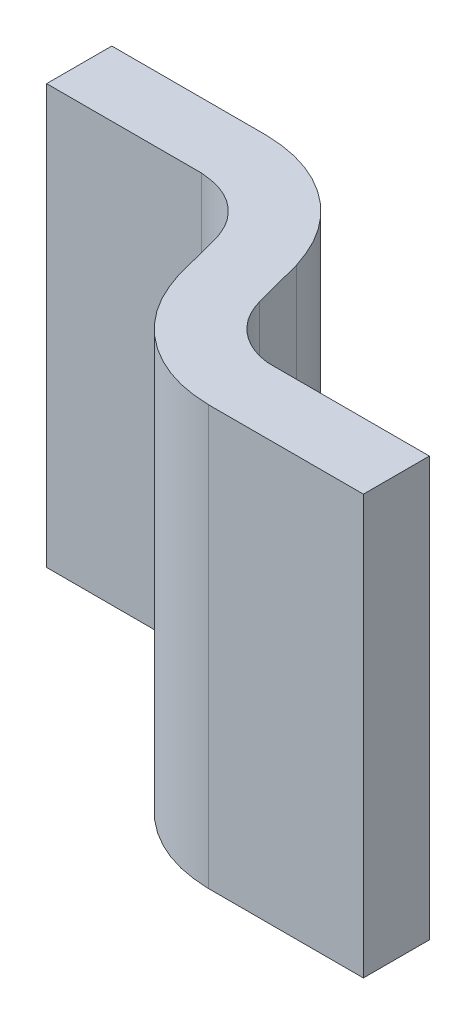
ISO-10303-21;
HEADER;
FILE_DESCRIPTION(('STEP AP214'),'2;1');
FILE_NAME('part.step','',(''),(''),'','','');
FILE_SCHEMA(('AUTOMOTIVE_DESIGN { 1 0 10303 214 1 1 1 1 }'));
ENDSEC;
DATA;
#1=APPLICATION_CONTEXT('core data for automotive mechanical design processes');
#2=APPLICATION_PROTOCOL_DEFINITION('international standard','automotive_design',2000,#1);
#3=PRODUCT_CONTEXT('',#1,'mechanical');
#4=PRODUCT('Part','Part','',(#3));
#5=PRODUCT_RELATED_PRODUCT_CATEGORY('part','',(#4));
#6=PRODUCT_DEFINITION_FORMATION('','',#4);
#7=PRODUCT_DEFINITION_CONTEXT('part definition',#1,'design');
#8=PRODUCT_DEFINITION('design','',#6,#7);
#9=PRODUCT_DEFINITION_SHAPE('','',#8);
#10=(LENGTH_UNIT() NAMED_UNIT(*) SI_UNIT(.MILLI.,.METRE.));
#11=(NAMED_UNIT(*) PLANE_ANGLE_UNIT() SI_UNIT($,.RADIAN.));
#12=(NAMED_UNIT(*) SI_UNIT($,.STERADIAN.) SOLID_ANGLE_UNIT());
#13=UNCERTAINTY_MEASURE_WITH_UNIT(LENGTH_MEASURE(1.E-05),#10,'distance_accuracy_value','');
#14=(GEOMETRIC_REPRESENTATION_CONTEXT(3) GLOBAL_UNCERTAINTY_ASSIGNED_CONTEXT((#13)) GLOBAL_UNIT_ASSIGNED_CONTEXT((#10,
#11,#12)) REPRESENTATION_CONTEXT('',''));
#15=CARTESIAN_POINT('',(0.,0.,0.));
#16=DIRECTION('',(0.,0.,1.));
#17=DIRECTION('',(1.,0.,0.));
#18=AXIS2_PLACEMENT_3D('',#15,#16,#17);
#19=CARTESIAN_POINT('',(-0.876,-1.204,0.238));
#20=DIRECTION('',(1.,0.,0.));
#21=DIRECTION('',(0.,0.,1.));
#22=AXIS2_PLACEMENT_3D('',#19,#20,#21);
#23=PLANE('',#22);
#24=DIRECTION('',(0.,-1.,0.));
#25=VECTOR('',#24,1.);
#26=CARTESIAN_POINT('',(-0.876,-0.696,0.238));
#27=LINE('',#26,#25);
#28=CARTESIAN_POINT('',(-0.876,-0.696,0.238));
#29=VERTEX_POINT('',#28);
#30=CARTESIAN_POINT('',(-0.876,-1.204,0.238));
#31=VERTEX_POINT('',#30);
#32=EDGE_CURVE('E11',#29,#31,#27,.T.);
#33=ORIENTED_EDGE('',*,*,#32,.F.);
#34=DIRECTION('',(0.,0.,-1.));
#35=VECTOR('',#34,1.);
#36=CARTESIAN_POINT('',(-0.876,-0.696,0.318));
#37=LINE('',#36,#35);
#38=CARTESIAN_POINT('',(-0.876,-0.696,0.318));
#39=VERTEX_POINT('',#38);
#40=EDGE_CURVE('E24',#39,#29,#37,.T.);
#41=ORIENTED_EDGE('',*,*,#40,.F.);
#42=DIRECTION('',(0.,1.,0.));
#43=VECTOR('',#42,1.);
#44=CARTESIAN_POINT('',(-0.876,-1.204,0.318));
#45=LINE('',#44,#43);
#46=CARTESIAN_POINT('',(-0.876,-1.204,0.318));
#47=VERTEX_POINT('',#46);
#48=EDGE_CURVE('E439',#47,#39,#45,.T.);
#49=ORIENTED_EDGE('',*,*,#48,.F.);
#50=DIRECTION('',(0.,0.,1.));
#51=VECTOR('',#50,1.);
#52=CARTESIAN_POINT('',(-0.876,-1.204,0.238));
#53=LINE('',#52,#51);
#54=EDGE_CURVE('E437',#31,#47,#53,.T.);
#55=ORIENTED_EDGE('',*,*,#54,.F.);
#56=EDGE_LOOP('',(#33,#41,#49,#55));
#57=FACE_BOUND('',#56,.T.);
#58=ADVANCED_FACE('F17',(#57),#23,.T.);
#59=CARTESIAN_POINT('',(-0.876,-1.204,0.318));
#60=DIRECTION('',(0.,0.,1.));
#61=DIRECTION('',(0.,1.,0.));
#62=AXIS2_PLACEMENT_3D('',#59,#60,#61);
#63=PLANE('',#62);
#64=ORIENTED_EDGE('',*,*,#48,.T.);
#65=DIRECTION('',(1.,0.,0.));
#66=VECTOR('',#65,1.);
#67=CARTESIAN_POINT('',(-1.064,-0.696,0.318));
#68=LINE('',#67,#66);
#69=CARTESIAN_POINT('',(-1.064,-0.696,0.318));
#70=VERTEX_POINT('',#69);
#71=EDGE_CURVE('E435',#70,#39,#68,.T.);
#72=ORIENTED_EDGE('',*,*,#71,.F.);
#73=CARTESIAN_POINT('',(-1.064,-1.204,0.31775));
#74=DIRECTION('',(0.,1.,0.));
#75=VECTOR('',#74,1.);
#76=LINE('',#73,#75);
#77=CARTESIAN_POINT('',(-1.064,-1.204,0.318));
#78=VERTEX_POINT('',#77);
#79=EDGE_CURVE('E257',#78,#70,#76,.T.);
#80=ORIENTED_EDGE('',*,*,#79,.F.);
#81=DIRECTION('',(-1.,0.,0.));
#82=VECTOR('',#81,1.);
#83=CARTESIAN_POINT('',(-0.876,-1.204,0.318));
#84=LINE('',#83,#82);
#85=EDGE_CURVE('E247',#47,#78,#84,.T.);
#86=ORIENTED_EDGE('',*,*,#85,.F.);
#87=EDGE_LOOP('',(#64,#72,#80,#86));
#88=FACE_BOUND('',#87,.T.);
#89=ADVANCED_FACE('F237',(#88),#63,.T.);
#90=CARTESIAN_POINT('',(-0.876,-0.696,0.238));
#91=DIRECTION('',(0.,0.,-1.));
#92=DIRECTION('',(0.,1.,0.));
#93=AXIS2_PLACEMENT_3D('',#90,#91,#92);
#94=PLANE('',#93);
#95=ORIENTED_EDGE('',*,*,#32,.T.);
#96=DIRECTION('',(1.,0.,0.));
#97=VECTOR('',#96,1.);
#98=CARTESIAN_POINT('',(-1.064,-1.204,0.238));
#99=LINE('',#98,#97);
#100=CARTESIAN_POINT('',(-1.064,-1.204,0.238));
#101=VERTEX_POINT('',#100);
#102=EDGE_CURVE('E443',#101,#31,#99,.T.);
#103=ORIENTED_EDGE('',*,*,#102,.F.);
#104=CARTESIAN_POINT('',(-1.064,-0.696,0.238375));
#105=DIRECTION('',(0.,-1.,0.));
#106=VECTOR('',#105,1.);
#107=LINE('',#104,#106);
#108=CARTESIAN_POINT('',(-1.064,-0.696,0.238));
#109=VERTEX_POINT('',#108);
#110=EDGE_CURVE('E222',#109,#101,#107,.T.);
#111=ORIENTED_EDGE('',*,*,#110,.F.);
#112=DIRECTION('',(-1.,0.,0.));
#113=VECTOR('',#112,1.);
#114=CARTESIAN_POINT('',(-0.876,-0.696,0.238));
#115=LINE('',#114,#113);
#116=EDGE_CURVE('E219',#29,#109,#115,.T.);
#117=ORIENTED_EDGE('',*,*,#116,.F.);
#118=EDGE_LOOP('',(#95,#103,#111,#117));
#119=FACE_BOUND('',#118,.T.);
#120=ADVANCED_FACE('F228',(#119),#94,.T.);
#121=CARTESIAN_POINT('',(-1.234,-0.696,0.138));
#122=DIRECTION('',(-0.965885549343203,0.,0.258969313954337));
#123=DIRECTION('',(0.258969313954337,0.,0.965885549343203));
#124=AXIS2_PLACEMENT_3D('',#121,#122,#123);
#125=PLANE('',#124);
#126=CARTESIAN_POINT('',(-1.23442187168926,-1.204,0.138115055915251));
#127=DIRECTION('',(0.,1.,0.));
#128=VECTOR('',#127,1.);
#129=LINE('',#126,#128);
#130=CARTESIAN_POINT('',(-1.234,-1.204,0.138));
#131=VERTEX_POINT('',#130);
#132=CARTESIAN_POINT('',(-1.234,-0.696,0.138));
#133=VERTEX_POINT('',#132);
#134=EDGE_CURVE('E215',#131,#133,#129,.T.);
#135=ORIENTED_EDGE('',*,*,#134,.F.);
#136=CARTESIAN_POINT('',(-1.218,-1.204,0.2));
#137=DIRECTION('',(-0.258969313954338,0.,-0.965885549343202));
#138=VECTOR('',#137,1.);
#139=LINE('',#136,#138);
#140=CARTESIAN_POINT('',(-1.218,-1.204,0.2));
#141=VERTEX_POINT('',#140);
#142=EDGE_CURVE('E301',#141,#131,#139,.T.);
#143=ORIENTED_EDGE('',*,*,#142,.F.);
#144=CARTESIAN_POINT('',(-1.21740631765688,-0.696,0.199841941713844));
#145=DIRECTION('',(0.,-1.,0.));
#146=VECTOR('',#145,1.);
#147=LINE('',#144,#146);
#148=CARTESIAN_POINT('',(-1.218,-0.696,0.2));
#149=VERTEX_POINT('',#148);
#150=EDGE_CURVE('E288',#149,#141,#147,.T.);
#151=ORIENTED_EDGE('',*,*,#150,.F.);
#152=DIRECTION('',(0.258969313954337,0.,0.965885549343203));
#153=VECTOR('',#152,1.);
#154=CARTESIAN_POINT('',(-1.234,-0.696,0.138));
#155=LINE('',#154,#153);
#156=EDGE_CURVE('E356',#133,#149,#155,.T.);
#157=ORIENTED_EDGE('',*,*,#156,.F.);
#158=EDGE_LOOP('',(#135,#143,#151,#157));
#159=FACE_BOUND('',#158,.T.);
#160=ADVANCED_FACE('F236',(#159),#125,.T.);
#161=CARTESIAN_POINT('',(-1.157,-1.204,0.118));
#162=DIRECTION('',(0.965885549343203,0.,-0.258969313954337));
#163=DIRECTION('',(0.258969313954337,0.,0.965885549343203));
#164=AXIS2_PLACEMENT_3D('',#161,#162,#163);
#165=PLANE('',#164);
#166=CARTESIAN_POINT('',(-1.15759368234312,-0.696,0.118158058286156));
#167=DIRECTION('',(0.,-1.,0.));
#168=VECTOR('',#167,1.);
#169=LINE('',#166,#168);
#170=CARTESIAN_POINT('',(-1.157,-0.696,0.118));
#171=VERTEX_POINT('',#170);
#172=CARTESIAN_POINT('',(-1.157,-1.204,0.118));
#173=VERTEX_POINT('',#172);
#174=EDGE_CURVE('E342',#171,#173,#169,.T.);
#175=ORIENTED_EDGE('',*,*,#174,.F.);
#176=CARTESIAN_POINT('',(-1.141,-0.696,0.179));
#177=DIRECTION('',(-0.258969313954335,0.,-0.965885549343203));
#178=VECTOR('',#177,1.);
#179=LINE('',#176,#178);
#180=CARTESIAN_POINT('',(-1.141,-0.696,0.179));
#181=VERTEX_POINT('',#180);
#182=EDGE_CURVE('E330',#181,#171,#179,.T.);
#183=ORIENTED_EDGE('',*,*,#182,.F.);
#184=CARTESIAN_POINT('',(-1.14082576891933,-1.204,0.178954745173853));
#185=DIRECTION('',(0.,1.,0.));
#186=VECTOR('',#185,1.);
#187=LINE('',#184,#186);
#188=CARTESIAN_POINT('',(-1.141,-1.204,0.179));
#189=VERTEX_POINT('',#188);
#190=EDGE_CURVE('E366',#189,#181,#187,.T.);
#191=ORIENTED_EDGE('',*,*,#190,.F.);
#192=DIRECTION('',(0.258969313954337,0.,0.965885549343203));
#193=VECTOR('',#192,1.);
#194=CARTESIAN_POINT('',(-1.157,-1.204,0.118));
#195=LINE('',#194,#193);
#196=EDGE_CURVE('E368',#173,#189,#195,.T.);
#197=ORIENTED_EDGE('',*,*,#196,.F.);
#198=EDGE_LOOP('',(#175,#183,#191,#197));
#199=FACE_BOUND('',#198,.T.);
#200=ADVANCED_FACE('F160',(#199),#165,.T.);
#201=CARTESIAN_POINT('',(-1.499,-0.696,0.079));
#202=DIRECTION('',(0.,0.,1.));
#203=DIRECTION('',(0.,1.,0.));
#204=AXIS2_PLACEMENT_3D('',#201,#202,#203);
#205=PLANE('',#204);
#206=DIRECTION('',(0.,1.,0.));
#207=VECTOR('',#206,1.);
#208=CARTESIAN_POINT('',(-1.499,-1.204,0.079));
#209=LINE('',#208,#207);
#210=CARTESIAN_POINT('',(-1.499,-1.204,0.079));
#211=VERTEX_POINT('',#210);
#212=CARTESIAN_POINT('',(-1.499,-0.696,0.079));
#213=VERTEX_POINT('',#212);
#214=EDGE_CURVE('E125',#211,#213,#209,.T.);
#215=ORIENTED_EDGE('',*,*,#214,.F.);
#216=DIRECTION('',(-1.,0.,0.));
#217=VECTOR('',#216,1.);
#218=CARTESIAN_POINT('',(-1.311,-1.204,0.079));
#219=LINE('',#218,#217);
#220=CARTESIAN_POINT('',(-1.311,-1.204,0.079));
#221=VERTEX_POINT('',#220);
#222=EDGE_CURVE('E377',#221,#211,#219,.T.);
#223=ORIENTED_EDGE('',*,*,#222,.F.);
#224=CARTESIAN_POINT('',(-1.311,-0.696,0.079625));
#225=DIRECTION('',(0.,-1.,0.));
#226=VECTOR('',#225,1.);
#227=LINE('',#224,#226);
#228=CARTESIAN_POINT('',(-1.311,-0.696,0.079));
#229=VERTEX_POINT('',#228);
#230=EDGE_CURVE('E178',#229,#221,#227,.T.);
#231=ORIENTED_EDGE('',*,*,#230,.F.);
#232=DIRECTION('',(1.,0.,0.));
#233=VECTOR('',#232,1.);
#234=CARTESIAN_POINT('',(-1.499,-0.696,0.079));
#235=LINE('',#234,#233);
#236=EDGE_CURVE('E169',#213,#229,#235,.T.);
#237=ORIENTED_EDGE('',*,*,#236,.F.);
#238=EDGE_LOOP('',(#215,#223,#231,#237));
#239=FACE_BOUND('',#238,.T.);
#240=ADVANCED_FACE('F155',(#239),#205,.T.);
#241=CARTESIAN_POINT('',(-1.311,-0.696,0.));
#242=DIRECTION('',(0.,0.,-1.));
#243=DIRECTION('',(0.,1.,0.));
#244=AXIS2_PLACEMENT_3D('',#241,#242,#243);
#245=PLANE('',#244);
#246=CARTESIAN_POINT('',(-1.311,-1.204,0.000249999999999979));
#247=DIRECTION('',(0.,1.,0.));
#248=VECTOR('',#247,1.);
#249=LINE('',#246,#248);
#250=CARTESIAN_POINT('',(-1.311,-1.204,0.));
#251=VERTEX_POINT('',#250);
#252=CARTESIAN_POINT('',(-1.311,-0.696,0.));
#253=VERTEX_POINT('',#252);
#254=EDGE_CURVE('E140',#251,#253,#249,.T.);
#255=ORIENTED_EDGE('',*,*,#254,.F.);
#256=DIRECTION('',(1.,0.,0.));
#257=VECTOR('',#256,1.);
#258=CARTESIAN_POINT('',(-1.499,-1.204,0.));
#259=LINE('',#258,#257);
#260=CARTESIAN_POINT('',(-1.499,-1.204,0.));
#261=VERTEX_POINT('',#260);
#262=EDGE_CURVE('E107',#261,#251,#259,.T.);
#263=ORIENTED_EDGE('',*,*,#262,.F.);
#264=DIRECTION('',(0.,-1.,0.));
#265=VECTOR('',#264,1.);
#266=CARTESIAN_POINT('',(-1.499,-0.696,0.));
#267=LINE('',#266,#265);
#268=CARTESIAN_POINT('',(-1.499,-0.696,0.));
#269=VERTEX_POINT('',#268);
#270=EDGE_CURVE('E101',#269,#261,#267,.T.);
#271=ORIENTED_EDGE('',*,*,#270,.F.);
#272=DIRECTION('',(-1.,0.,0.));
#273=VECTOR('',#272,1.);
#274=CARTESIAN_POINT('',(-1.311,-0.696,0.));
#275=LINE('',#274,#273);
#276=EDGE_CURVE('E104',#253,#269,#275,.T.);
#277=ORIENTED_EDGE('',*,*,#276,.F.);
#278=EDGE_LOOP('',(#255,#263,#271,#277));
#279=FACE_BOUND('',#278,.T.);
#280=ADVANCED_FACE('F103',(#279),#245,.T.);
#281=CARTESIAN_POINT('',(-1.499,-0.696,0.));
#282=DIRECTION('',(-1.,0.,0.));
#283=DIRECTION('',(0.,0.,1.));
#284=AXIS2_PLACEMENT_3D('',#281,#282,#283);
#285=PLANE('',#284);
#286=ORIENTED_EDGE('',*,*,#270,.T.);
#287=DIRECTION('',(0.,0.,-1.));
#288=VECTOR('',#287,1.);
#289=CARTESIAN_POINT('',(-1.499,-1.204,0.079));
#290=LINE('',#289,#288);
#291=EDGE_CURVE('E122',#211,#261,#290,.T.);
#292=ORIENTED_EDGE('',*,*,#291,.F.);
#293=ORIENTED_EDGE('',*,*,#214,.T.);
#294=DIRECTION('',(0.,0.,1.));
#295=VECTOR('',#294,1.);
#296=CARTESIAN_POINT('',(-1.499,-0.696,0.));
#297=LINE('',#296,#295);
#298=EDGE_CURVE('E118',#269,#213,#297,.T.);
#299=ORIENTED_EDGE('',*,*,#298,.F.);
#300=EDGE_LOOP('',(#286,#292,#293,#299));
#301=FACE_BOUND('',#300,.T.);
#302=ADVANCED_FACE('F124',(#301),#285,.T.);
#303=CARTESIAN_POINT('',(-1.064,-1.204,0.159));
#304=DIRECTION('',(0.,-1.,0.));
#305=DIRECTION('',(0.,0.,1.));
#306=AXIS2_PLACEMENT_3D('',#303,#304,#305);
#307=CYLINDRICAL_SURFACE('',#306,0.15875);
#308=ORIENTED_EDGE('',*,*,#79,.T.);
#309=CARTESIAN_POINT('',(-1.064,-0.696,0.159));
#310=DIRECTION('',(0.,1.,0.));
#311=DIRECTION('',(0.793107076683516,0.,0.609082231652284));
#312=AXIS2_PLACEMENT_3D('',#309,#310,#311);
#313=CIRCLE('',#312,0.15875);
#314=EDGE_CURVE('E127',#149,#70,#313,.T.);
#315=ORIENTED_EDGE('',*,*,#314,.F.);
#316=ORIENTED_EDGE('',*,*,#150,.T.);
#317=CARTESIAN_POINT('',(-1.064,-1.204,0.159));
#318=DIRECTION('',(0.,-1.,0.));
#319=DIRECTION('',(-0.793107076683516,0.,-0.609082231652284));
#320=AXIS2_PLACEMENT_3D('',#317,#318,#319);
#321=CIRCLE('',#320,0.15875);
#322=EDGE_CURVE('E131',#78,#141,#321,.T.);
#323=ORIENTED_EDGE('',*,*,#322,.F.);
#324=EDGE_LOOP('',(#308,#315,#316,#323));
#325=FACE_BOUND('',#324,.T.);
#326=ADVANCED_FACE('F263',(#325),#307,.T.);
#327=CARTESIAN_POINT('',(-1.064,-0.696,0.159));
#328=DIRECTION('',(0.,-1.,0.));
#329=DIRECTION('',(0.,0.,-1.));
#330=AXIS2_PLACEMENT_3D('',#327,#328,#329);
#331=CYLINDRICAL_SURFACE('',#330,0.079375);
#332=ORIENTED_EDGE('',*,*,#110,.T.);
#333=CARTESIAN_POINT('',(-1.064,-1.204,0.159));
#334=DIRECTION('',(0.,1.,0.));
#335=DIRECTION('',(0.793107076683516,0.,0.609082231652284));
#336=AXIS2_PLACEMENT_3D('',#333,#334,#335);
#337=CIRCLE('',#336,0.079375);
#338=EDGE_CURVE('E427',#189,#101,#337,.T.);
#339=ORIENTED_EDGE('',*,*,#338,.F.);
#340=ORIENTED_EDGE('',*,*,#190,.T.);
#341=CARTESIAN_POINT('',(-1.064,-0.696,0.159));
#342=DIRECTION('',(0.,-1.,0.));
#343=DIRECTION('',(-0.793107076683516,0.,-0.609082231652284));
#344=AXIS2_PLACEMENT_3D('',#341,#342,#343);
#345=CIRCLE('',#344,0.079375);
#346=EDGE_CURVE('E423',#109,#181,#345,.T.);
#347=ORIENTED_EDGE('',*,*,#346,.F.);
#348=EDGE_LOOP('',(#332,#339,#340,#347));
#349=FACE_BOUND('',#348,.T.);
#350=ADVANCED_FACE('F195',(#349),#331,.F.);
#351=CARTESIAN_POINT('',(-1.311,-0.696,0.159));
#352=DIRECTION('',(0.,-1.,0.));
#353=DIRECTION('',(0.,0.,1.));
#354=AXIS2_PLACEMENT_3D('',#351,#352,#353);
#355=CYLINDRICAL_SURFACE('',#354,0.079375);
#356=ORIENTED_EDGE('',*,*,#230,.T.);
#357=CARTESIAN_POINT('',(-1.311,-1.204,0.159));
#358=DIRECTION('',(0.,1.,0.));
#359=DIRECTION('',(-0.793107076683516,0.,-0.609082231652284));
#360=AXIS2_PLACEMENT_3D('',#357,#358,#359);
#361=CIRCLE('',#360,0.079375);
#362=EDGE_CURVE('E418',#131,#221,#361,.T.);
#363=ORIENTED_EDGE('',*,*,#362,.F.);
#364=ORIENTED_EDGE('',*,*,#134,.T.);
#365=CARTESIAN_POINT('',(-1.311,-0.696,0.159));
#366=DIRECTION('',(0.,-1.,0.));
#367=DIRECTION('',(0.793107076683516,0.,0.609082231652284));
#368=AXIS2_PLACEMENT_3D('',#365,#366,#367);
#369=CIRCLE('',#368,0.079375);
#370=EDGE_CURVE('E408',#229,#133,#369,.T.);
#371=ORIENTED_EDGE('',*,*,#370,.F.);
#372=EDGE_LOOP('',(#356,#363,#364,#371));
#373=FACE_BOUND('',#372,.T.);
#374=ADVANCED_FACE('F184',(#373),#355,.F.);
#375=CARTESIAN_POINT('',(-1.311,-0.696,0.159));
#376=DIRECTION('',(0.,-1.,0.));
#377=DIRECTION('',(0.,0.,-1.));
#378=AXIS2_PLACEMENT_3D('',#375,#376,#377);
#379=CYLINDRICAL_SURFACE('',#378,0.15875);
#380=ORIENTED_EDGE('',*,*,#254,.T.);
#381=CARTESIAN_POINT('',(-1.311,-0.696,0.159));
#382=DIRECTION('',(0.,1.,0.));
#383=DIRECTION('',(-0.793107076683516,0.,-0.609082231652284));
#384=AXIS2_PLACEMENT_3D('',#381,#382,#383);
#385=CIRCLE('',#384,0.15875);
#386=EDGE_CURVE('E121',#171,#253,#385,.T.);
#387=ORIENTED_EDGE('',*,*,#386,.F.);
#388=ORIENTED_EDGE('',*,*,#174,.T.);
#389=CARTESIAN_POINT('',(-1.311,-1.204,0.159));
#390=DIRECTION('',(0.,-1.,0.));
#391=DIRECTION('',(0.793107076683516,0.,0.609082231652284));
#392=AXIS2_PLACEMENT_3D('',#389,#390,#391);
#393=CIRCLE('',#392,0.15875);
#394=EDGE_CURVE('E405',#251,#173,#393,.T.);
#395=ORIENTED_EDGE('',*,*,#394,.F.);
#396=EDGE_LOOP('',(#380,#387,#388,#395));
#397=FACE_BOUND('',#396,.T.);
#398=ADVANCED_FACE('F194',(#397),#379,.T.);
#399=CARTESIAN_POINT('',(-0.876,-0.696,0.238));
#400=DIRECTION('',(0.,1.,0.));
#401=DIRECTION('',(1.,0.,0.));
#402=AXIS2_PLACEMENT_3D('',#399,#400,#401);
#403=PLANE('',#402);
#404=ORIENTED_EDGE('',*,*,#71,.T.);
#405=ORIENTED_EDGE('',*,*,#40,.T.);
#406=ORIENTED_EDGE('',*,*,#116,.T.);
#407=ORIENTED_EDGE('',*,*,#346,.T.);
#408=ORIENTED_EDGE('',*,*,#182,.T.);
#409=ORIENTED_EDGE('',*,*,#386,.T.);
#410=ORIENTED_EDGE('',*,*,#276,.T.);
#411=ORIENTED_EDGE('',*,*,#298,.T.);
#412=ORIENTED_EDGE('',*,*,#236,.T.);
#413=ORIENTED_EDGE('',*,*,#370,.T.);
#414=ORIENTED_EDGE('',*,*,#156,.T.);
#415=ORIENTED_EDGE('',*,*,#314,.T.);
#416=EDGE_LOOP('',(#404,#405,#406,#407,#408,#409,#410,#411,#412,#413,#414,#415));
#417=FACE_BOUND('',#416,.T.);
#418=ADVANCED_FACE('F116',(#417),#403,.T.);
#419=CARTESIAN_POINT('',(-1.311,-1.204,0.079));
#420=DIRECTION('',(0.,-1.,0.));
#421=DIRECTION('',(1.,0.,0.));
#422=AXIS2_PLACEMENT_3D('',#419,#420,#421);
#423=PLANE('',#422);
#424=ORIENTED_EDGE('',*,*,#102,.T.);
#425=ORIENTED_EDGE('',*,*,#54,.T.);
#426=ORIENTED_EDGE('',*,*,#85,.T.);
#427=ORIENTED_EDGE('',*,*,#322,.T.);
#428=ORIENTED_EDGE('',*,*,#142,.T.);
#429=ORIENTED_EDGE('',*,*,#362,.T.);
#430=ORIENTED_EDGE('',*,*,#222,.T.);
#431=ORIENTED_EDGE('',*,*,#291,.T.);
#432=ORIENTED_EDGE('',*,*,#262,.T.);
#433=ORIENTED_EDGE('',*,*,#394,.T.);
#434=ORIENTED_EDGE('',*,*,#196,.T.);
#435=ORIENTED_EDGE('',*,*,#338,.T.);
#436=EDGE_LOOP('',(#424,#425,#426,#427,#428,#429,#430,#431,#432,#433,#434,#435));
#437=FACE_BOUND('',#436,.T.);
#438=ADVANCED_FACE('F306',(#437),#423,.T.);
#439=CLOSED_SHELL('',(#58,#89,#120,#160,#200,#240,#280,#302,#326,#350,#374,#398,#418,#438));
#440=MANIFOLD_SOLID_BREP('B1',#439);
#441=ADVANCED_BREP_SHAPE_REPRESENTATION('',(#18,#440),#14);
#442=SHAPE_DEFINITION_REPRESENTATION(#9,#441);
ENDSEC;
END-ISO-10303-21;
